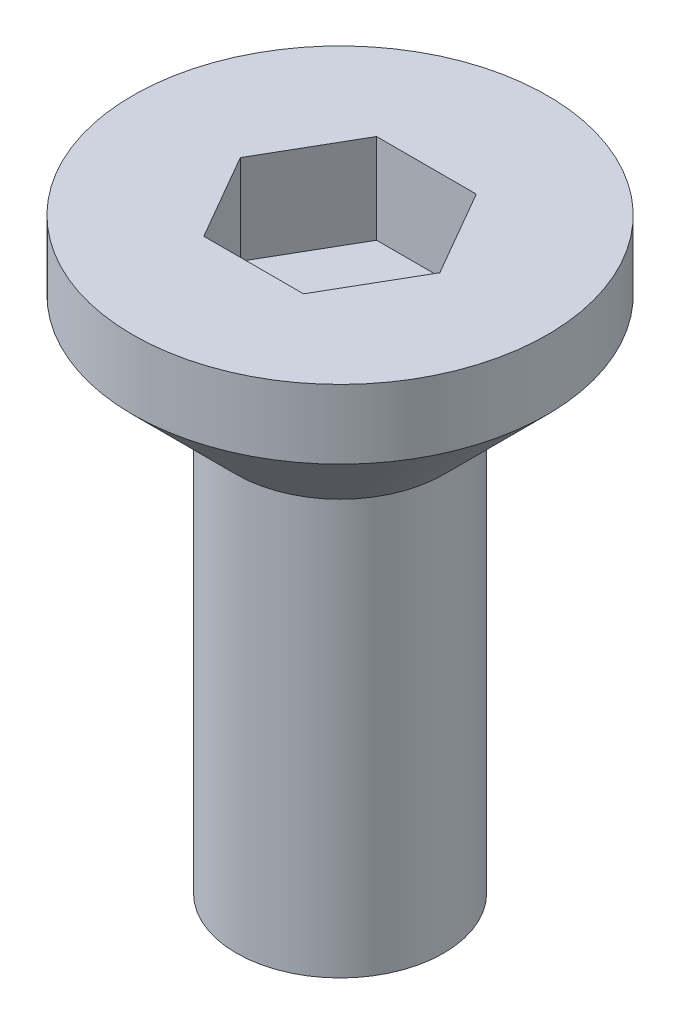
ISO-10303-21;
HEADER;
FILE_DESCRIPTION(('STEP AP214'),'2;1');
FILE_NAME('part.step','',(''),(''),'','','');
FILE_SCHEMA(('AUTOMOTIVE_DESIGN { 1 0 10303 214 1 1 1 1 }'));
ENDSEC;
DATA;
#1=APPLICATION_CONTEXT('core data for automotive mechanical design processes');
#2=APPLICATION_PROTOCOL_DEFINITION('international standard','automotive_design',2000,#1);
#3=PRODUCT_CONTEXT('',#1,'mechanical');
#4=PRODUCT('Part','Part','',(#3));
#5=PRODUCT_RELATED_PRODUCT_CATEGORY('part','',(#4));
#6=PRODUCT_DEFINITION_FORMATION('','',#4);
#7=PRODUCT_DEFINITION_CONTEXT('part definition',#1,'design');
#8=PRODUCT_DEFINITION('design','',#6,#7);
#9=PRODUCT_DEFINITION_SHAPE('','',#8);
#10=(LENGTH_UNIT() NAMED_UNIT(*) SI_UNIT(.MILLI.,.METRE.));
#11=(NAMED_UNIT(*) PLANE_ANGLE_UNIT() SI_UNIT($,.RADIAN.));
#12=(NAMED_UNIT(*) SI_UNIT($,.STERADIAN.) SOLID_ANGLE_UNIT());
#13=UNCERTAINTY_MEASURE_WITH_UNIT(LENGTH_MEASURE(1.E-05),#10,'distance_accuracy_value','');
#14=(GEOMETRIC_REPRESENTATION_CONTEXT(3) GLOBAL_UNCERTAINTY_ASSIGNED_CONTEXT((#13)) GLOBAL_UNIT_ASSIGNED_CONTEXT((#10,
#11,#12)) REPRESENTATION_CONTEXT('',''));
#15=CARTESIAN_POINT('',(0.,0.,0.));
#16=DIRECTION('',(0.,0.,1.));
#17=DIRECTION('',(1.,0.,0.));
#18=AXIS2_PLACEMENT_3D('',#15,#16,#17);
#19=CARTESIAN_POINT('',(0.,2.5,0.));
#20=DIRECTION('',(0.,-1.,0.));
#21=DIRECTION('',(0.,0.,-1.));
#22=AXIS2_PLACEMENT_3D('',#19,#20,#21);
#23=CYLINDRICAL_SURFACE('',#22,3.);
#24=CARTESIAN_POINT('',(0.,1.5,0.));
#25=DIRECTION('',(0.,1.,0.));
#26=DIRECTION('',(0.,0.,1.));
#27=AXIS2_PLACEMENT_3D('',#24,#25,#26);
#28=CIRCLE('',#27,3.);
#29=CARTESIAN_POINT('',(0.,1.5,3.));
#30=VERTEX_POINT('',#29);
#31=EDGE_CURVE('E45',#30,#30,#28,.T.);
#32=ORIENTED_EDGE('',*,*,#31,.T.);
#33=EDGE_LOOP('',(#32));
#34=FACE_BOUND('',#33,.T.);
#35=CARTESIAN_POINT('',(0.,2.5,0.));
#36=DIRECTION('',(0.,1.,0.));
#37=DIRECTION('',(0.,0.,1.));
#38=AXIS2_PLACEMENT_3D('',#35,#36,#37);
#39=CIRCLE('',#38,3.);
#40=CARTESIAN_POINT('',(0.,2.5,3.));
#41=VERTEX_POINT('',#40);
#42=EDGE_CURVE('E140',#41,#41,#39,.T.);
#43=ORIENTED_EDGE('',*,*,#42,.F.);
#44=EDGE_LOOP('',(#43));
#45=FACE_BOUND('',#44,.T.);
#46=ADVANCED_FACE('F37',(#34,#45),#23,.T.);
#47=CARTESIAN_POINT('',(0.,2.5,0.));
#48=DIRECTION('',(0.,1.,0.));
#49=DIRECTION('',(0.,0.,1.));
#50=AXIS2_PLACEMENT_3D('',#47,#48,#49);
#51=PLANE('',#50);
#52=DIRECTION('',(0.5,0.,-0.866025403784439));
#53=VECTOR('',#52,1.);
#54=CARTESIAN_POINT('',(0.721687836487032,2.5,1.25));
#55=LINE('',#54,#53);
#56=CARTESIAN_POINT('',(0.721687836487032,2.5,1.25));
#57=VERTEX_POINT('',#56);
#58=CARTESIAN_POINT('',(1.44337567297406,2.5,0.));
#59=VERTEX_POINT('',#58);
#60=EDGE_CURVE('E52',#57,#59,#55,.T.);
#61=ORIENTED_EDGE('',*,*,#60,.F.);
#62=DIRECTION('',(1.,0.,0.));
#63=VECTOR('',#62,1.);
#64=CARTESIAN_POINT('',(-0.721687836487033,2.5,1.25));
#65=LINE('',#64,#63);
#66=CARTESIAN_POINT('',(-0.721687836487033,2.5,1.25));
#67=VERTEX_POINT('',#66);
#68=EDGE_CURVE('E136',#67,#57,#65,.T.);
#69=ORIENTED_EDGE('',*,*,#68,.F.);
#70=DIRECTION('',(0.5,0.,0.866025403784439));
#71=VECTOR('',#70,1.);
#72=CARTESIAN_POINT('',(-1.44337567297407,2.5,0.));
#73=LINE('',#72,#71);
#74=CARTESIAN_POINT('',(-1.44337567297407,2.5,0.));
#75=VERTEX_POINT('',#74);
#76=EDGE_CURVE('E134',#75,#67,#73,.T.);
#77=ORIENTED_EDGE('',*,*,#76,.F.);
#78=DIRECTION('',(-0.5,0.,0.866025403784438));
#79=VECTOR('',#78,1.);
#80=CARTESIAN_POINT('',(-0.721687836487033,2.5,-1.25));
#81=LINE('',#80,#79);
#82=CARTESIAN_POINT('',(-0.721687836487033,2.5,-1.25));
#83=VERTEX_POINT('',#82);
#84=EDGE_CURVE('E100',#83,#75,#81,.T.);
#85=ORIENTED_EDGE('',*,*,#84,.F.);
#86=DIRECTION('',(-1.,0.,0.));
#87=VECTOR('',#86,1.);
#88=CARTESIAN_POINT('',(0.721687836487032,2.5,-1.25));
#89=LINE('',#88,#87);
#90=CARTESIAN_POINT('',(0.721687836487032,2.5,-1.25));
#91=VERTEX_POINT('',#90);
#92=EDGE_CURVE('E130',#91,#83,#89,.T.);
#93=ORIENTED_EDGE('',*,*,#92,.F.);
#94=DIRECTION('',(-0.5,0.,-0.866025403784439));
#95=VECTOR('',#94,1.);
#96=CARTESIAN_POINT('',(1.44337567297406,2.5,0.));
#97=LINE('',#96,#95);
#98=EDGE_CURVE('E126',#59,#91,#97,.T.);
#99=ORIENTED_EDGE('',*,*,#98,.F.);
#100=EDGE_LOOP('',(#61,#69,#77,#85,#93,#99));
#101=FACE_BOUND('',#100,.T.);
#102=ORIENTED_EDGE('',*,*,#42,.T.);
#103=EDGE_LOOP('',(#102));
#104=FACE_BOUND('',#103,.T.);
#105=ADVANCED_FACE('F154',(#101,#104),#51,.T.);
#106=CARTESIAN_POINT('',(0.,1.5,0.));
#107=DIRECTION('',(0.,1.,0.));
#108=DIRECTION('',(0.,0.,1.));
#109=AXIS2_PLACEMENT_3D('',#106,#107,#108);
#110=CONICAL_SURFACE('',#109,3.,0.78539816339745);
#111=CARTESIAN_POINT('',(0.,0.,0.));
#112=DIRECTION('',(0.,1.,0.));
#113=DIRECTION('',(0.,0.,1.));
#114=AXIS2_PLACEMENT_3D('',#111,#112,#113);
#115=CIRCLE('',#114,1.49999999999999);
#116=CARTESIAN_POINT('',(0.,0.,1.49999999999999));
#117=VERTEX_POINT('',#116);
#118=EDGE_CURVE('E11',#117,#117,#115,.F.);
#119=ORIENTED_EDGE('',*,*,#118,.F.);
#120=EDGE_LOOP('',(#119));
#121=FACE_BOUND('',#120,.T.);
#122=ORIENTED_EDGE('',*,*,#31,.F.);
#123=EDGE_LOOP('',(#122));
#124=FACE_BOUND('',#123,.T.);
#125=ADVANCED_FACE('F39',(#121,#124),#110,.T.);
#126=CARTESIAN_POINT('',(0.721687836487032,1.2,1.25));
#127=DIRECTION('',(0.866025403784439,0.,0.5));
#128=DIRECTION('',(0.5,0.,-0.866025403784439));
#129=AXIS2_PLACEMENT_3D('',#126,#127,#128);
#130=PLANE('',#129);
#131=ORIENTED_EDGE('',*,*,#60,.T.);
#132=DIRECTION('',(0.,1.,0.));
#133=VECTOR('',#132,1.);
#134=CARTESIAN_POINT('',(1.44337567297406,1.2,0.));
#135=LINE('',#134,#133);
#136=CARTESIAN_POINT('',(1.44337567297406,1.2,0.));
#137=VERTEX_POINT('',#136);
#138=EDGE_CURVE('E82',#137,#59,#135,.T.);
#139=ORIENTED_EDGE('',*,*,#138,.F.);
#140=DIRECTION('',(0.5,0.,-0.866025403784439));
#141=VECTOR('',#140,1.);
#142=CARTESIAN_POINT('',(0.721687836487032,1.2,1.25));
#143=LINE('',#142,#141);
#144=CARTESIAN_POINT('',(0.721687836487032,1.2,1.25));
#145=VERTEX_POINT('',#144);
#146=EDGE_CURVE('E138',#145,#137,#143,.T.);
#147=ORIENTED_EDGE('',*,*,#146,.F.);
#148=DIRECTION('',(0.,1.,0.));
#149=VECTOR('',#148,1.);
#150=CARTESIAN_POINT('',(0.721687836487032,1.2,1.25));
#151=LINE('',#150,#149);
#152=EDGE_CURVE('E60',#145,#57,#151,.T.);
#153=ORIENTED_EDGE('',*,*,#152,.T.);
#154=EDGE_LOOP('',(#131,#139,#147,#153));
#155=FACE_BOUND('',#154,.T.);
#156=ADVANCED_FACE('F153',(#155),#130,.F.);
#157=CARTESIAN_POINT('',(-0.721687836487033,1.2,1.25));
#158=DIRECTION('',(0.,0.,1.));
#159=DIRECTION('',(1.,0.,0.));
#160=AXIS2_PLACEMENT_3D('',#157,#158,#159);
#161=PLANE('',#160);
#162=ORIENTED_EDGE('',*,*,#68,.T.);
#163=ORIENTED_EDGE('',*,*,#152,.F.);
#164=DIRECTION('',(1.,0.,0.));
#165=VECTOR('',#164,1.);
#166=CARTESIAN_POINT('',(-0.721687836487033,1.2,1.25));
#167=LINE('',#166,#165);
#168=CARTESIAN_POINT('',(-0.721687836487033,1.2,1.25));
#169=VERTEX_POINT('',#168);
#170=EDGE_CURVE('E112',#169,#145,#167,.T.);
#171=ORIENTED_EDGE('',*,*,#170,.F.);
#172=DIRECTION('',(0.,1.,0.));
#173=VECTOR('',#172,1.);
#174=CARTESIAN_POINT('',(-0.721687836487033,1.2,1.25));
#175=LINE('',#174,#173);
#176=EDGE_CURVE('E104',#169,#67,#175,.T.);
#177=ORIENTED_EDGE('',*,*,#176,.T.);
#178=EDGE_LOOP('',(#162,#163,#171,#177));
#179=FACE_BOUND('',#178,.T.);
#180=ADVANCED_FACE('F160',(#179),#161,.F.);
#181=CARTESIAN_POINT('',(-1.44337567297407,1.2,0.));
#182=DIRECTION('',(-0.866025403784439,0.,0.5));
#183=DIRECTION('',(0.5,0.,0.866025403784439));
#184=AXIS2_PLACEMENT_3D('',#181,#182,#183);
#185=PLANE('',#184);
#186=ORIENTED_EDGE('',*,*,#76,.T.);
#187=ORIENTED_EDGE('',*,*,#176,.F.);
#188=DIRECTION('',(0.5,0.,0.866025403784439));
#189=VECTOR('',#188,1.);
#190=CARTESIAN_POINT('',(-1.44337567297407,1.2,0.));
#191=LINE('',#190,#189);
#192=CARTESIAN_POINT('',(-1.44337567297407,1.2,0.));
#193=VERTEX_POINT('',#192);
#194=EDGE_CURVE('E108',#193,#169,#191,.T.);
#195=ORIENTED_EDGE('',*,*,#194,.F.);
#196=DIRECTION('',(0.,1.,0.));
#197=VECTOR('',#196,1.);
#198=CARTESIAN_POINT('',(-1.44337567297407,1.2,0.));
#199=LINE('',#198,#197);
#200=EDGE_CURVE('E93',#193,#75,#199,.T.);
#201=ORIENTED_EDGE('',*,*,#200,.T.);
#202=EDGE_LOOP('',(#186,#187,#195,#201));
#203=FACE_BOUND('',#202,.T.);
#204=ADVANCED_FACE('F109',(#203),#185,.F.);
#205=CARTESIAN_POINT('',(-0.721687836487033,1.2,-1.25));
#206=DIRECTION('',(-0.866025403784439,0.,-0.5));
#207=DIRECTION('',(-0.5,0.,0.866025403784439));
#208=AXIS2_PLACEMENT_3D('',#205,#206,#207);
#209=PLANE('',#208);
#210=ORIENTED_EDGE('',*,*,#84,.T.);
#211=ORIENTED_EDGE('',*,*,#200,.F.);
#212=DIRECTION('',(-0.5,0.,0.866025403784438));
#213=VECTOR('',#212,1.);
#214=CARTESIAN_POINT('',(-0.721687836487033,1.2,-1.25));
#215=LINE('',#214,#213);
#216=CARTESIAN_POINT('',(-0.721687836487033,1.2,-1.25));
#217=VERTEX_POINT('',#216);
#218=EDGE_CURVE('E97',#217,#193,#215,.T.);
#219=ORIENTED_EDGE('',*,*,#218,.F.);
#220=DIRECTION('',(0.,1.,0.));
#221=VECTOR('',#220,1.);
#222=CARTESIAN_POINT('',(-0.721687836487033,1.2,-1.25));
#223=LINE('',#222,#221);
#224=EDGE_CURVE('E105',#217,#83,#223,.T.);
#225=ORIENTED_EDGE('',*,*,#224,.T.);
#226=EDGE_LOOP('',(#210,#211,#219,#225));
#227=FACE_BOUND('',#226,.T.);
#228=ADVANCED_FACE('F95',(#227),#209,.F.);
#229=CARTESIAN_POINT('',(0.721687836487032,1.2,-1.25));
#230=DIRECTION('',(0.,0.,-1.));
#231=DIRECTION('',(-1.,0.,0.));
#232=AXIS2_PLACEMENT_3D('',#229,#230,#231);
#233=PLANE('',#232);
#234=ORIENTED_EDGE('',*,*,#92,.T.);
#235=ORIENTED_EDGE('',*,*,#224,.F.);
#236=DIRECTION('',(-1.,0.,0.));
#237=VECTOR('',#236,1.);
#238=CARTESIAN_POINT('',(0.721687836487032,1.2,-1.25));
#239=LINE('',#238,#237);
#240=CARTESIAN_POINT('',(0.721687836487032,1.2,-1.25));
#241=VERTEX_POINT('',#240);
#242=EDGE_CURVE('E118',#241,#217,#239,.T.);
#243=ORIENTED_EDGE('',*,*,#242,.F.);
#244=DIRECTION('',(0.,1.,0.));
#245=VECTOR('',#244,1.);
#246=CARTESIAN_POINT('',(0.721687836487032,1.2,-1.25));
#247=LINE('',#246,#245);
#248=EDGE_CURVE('E143',#241,#91,#247,.T.);
#249=ORIENTED_EDGE('',*,*,#248,.T.);
#250=EDGE_LOOP('',(#234,#235,#243,#249));
#251=FACE_BOUND('',#250,.T.);
#252=ADVANCED_FACE('F172',(#251),#233,.F.);
#253=CARTESIAN_POINT('',(1.44337567297406,1.2,0.));
#254=DIRECTION('',(0.866025403784439,0.,-0.5));
#255=DIRECTION('',(-0.5,0.,-0.866025403784439));
#256=AXIS2_PLACEMENT_3D('',#253,#254,#255);
#257=PLANE('',#256);
#258=ORIENTED_EDGE('',*,*,#98,.T.);
#259=ORIENTED_EDGE('',*,*,#248,.F.);
#260=DIRECTION('',(-0.5,0.,-0.866025403784439));
#261=VECTOR('',#260,1.);
#262=CARTESIAN_POINT('',(1.44337567297406,1.2,0.));
#263=LINE('',#262,#261);
#264=EDGE_CURVE('E120',#137,#241,#263,.T.);
#265=ORIENTED_EDGE('',*,*,#264,.F.);
#266=ORIENTED_EDGE('',*,*,#138,.T.);
#267=EDGE_LOOP('',(#258,#259,#265,#266));
#268=FACE_BOUND('',#267,.T.);
#269=ADVANCED_FACE('F169',(#268),#257,.F.);
#270=CARTESIAN_POINT('',(0.,1.2,0.));
#271=DIRECTION('',(0.,1.,0.));
#272=DIRECTION('',(0.,0.,1.));
#273=AXIS2_PLACEMENT_3D('',#270,#271,#272);
#274=PLANE('',#273);
#275=ORIENTED_EDGE('',*,*,#146,.T.);
#276=ORIENTED_EDGE('',*,*,#264,.T.);
#277=ORIENTED_EDGE('',*,*,#242,.T.);
#278=ORIENTED_EDGE('',*,*,#218,.T.);
#279=ORIENTED_EDGE('',*,*,#194,.T.);
#280=ORIENTED_EDGE('',*,*,#170,.T.);
#281=EDGE_LOOP('',(#275,#276,#277,#278,#279,#280));
#282=FACE_BOUND('',#281,.T.);
#283=ADVANCED_FACE('F115',(#282),#274,.T.);
#284=CARTESIAN_POINT('',(0.,-6.,0.));
#285=DIRECTION('',(0.,1.,0.));
#286=DIRECTION('',(0.,0.,1.));
#287=AXIS2_PLACEMENT_3D('',#284,#285,#286);
#288=CYLINDRICAL_SURFACE('',#287,1.5);
#289=CARTESIAN_POINT('',(0.,-6.,0.));
#290=DIRECTION('',(0.,-1.,0.));
#291=DIRECTION('',(0.,0.,-1.));
#292=AXIS2_PLACEMENT_3D('',#289,#290,#291);
#293=CIRCLE('',#292,1.5);
#294=CARTESIAN_POINT('',(0.,-6.,-1.5));
#295=VERTEX_POINT('',#294);
#296=EDGE_CURVE('E127',#295,#295,#293,.T.);
#297=ORIENTED_EDGE('',*,*,#296,.F.);
#298=EDGE_LOOP('',(#297));
#299=FACE_BOUND('',#298,.T.);
#300=ORIENTED_EDGE('',*,*,#118,.T.);
#301=EDGE_LOOP('',(#300));
#302=FACE_BOUND('',#301,.T.);
#303=ADVANCED_FACE('F185',(#299,#302),#288,.T.);
#304=CARTESIAN_POINT('',(0.,-6.,0.));
#305=DIRECTION('',(0.,-1.,0.));
#306=DIRECTION('',(0.,0.,-1.));
#307=AXIS2_PLACEMENT_3D('',#304,#305,#306);
#308=PLANE('',#307);
#309=ORIENTED_EDGE('',*,*,#296,.T.);
#310=EDGE_LOOP('',(#309));
#311=FACE_BOUND('',#310,.T.);
#312=ADVANCED_FACE('F188',(#311),#308,.T.);
#313=CLOSED_SHELL('',(#46,#105,#125,#156,#180,#204,#228,#252,#269,#283,#303,#312));
#314=MANIFOLD_SOLID_BREP('B2',#313);
#315=ADVANCED_BREP_SHAPE_REPRESENTATION('',(#18,#314),#14);
#316=SHAPE_DEFINITION_REPRESENTATION(#9,#315);
ENDSEC;
END-ISO-10303-21;
